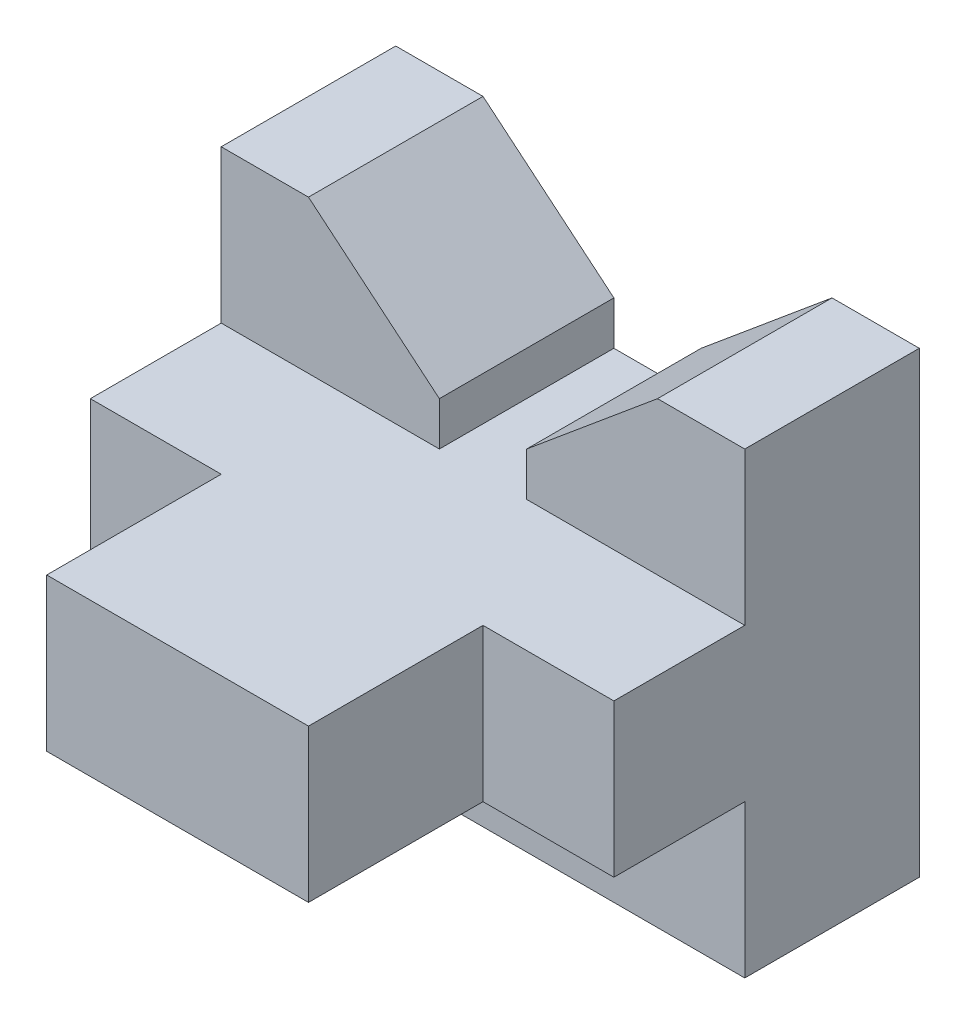
ISO-10303-21;
HEADER;
FILE_DESCRIPTION(('STEP AP214'),'2;1');
FILE_NAME('part.step','',(''),(''),'','','');
FILE_SCHEMA(('AUTOMOTIVE_DESIGN { 1 0 10303 214 1 1 1 1 }'));
ENDSEC;
DATA;
#1=APPLICATION_CONTEXT('core data for automotive mechanical design processes');
#2=APPLICATION_PROTOCOL_DEFINITION('international standard','automotive_design',2000,#1);
#3=PRODUCT_CONTEXT('',#1,'mechanical');
#4=PRODUCT('Part','Part','',(#3));
#5=PRODUCT_RELATED_PRODUCT_CATEGORY('part','',(#4));
#6=PRODUCT_DEFINITION_FORMATION('','',#4);
#7=PRODUCT_DEFINITION_CONTEXT('part definition',#1,'design');
#8=PRODUCT_DEFINITION('design','',#6,#7);
#9=PRODUCT_DEFINITION_SHAPE('','',#8);
#10=(LENGTH_UNIT() NAMED_UNIT(*) SI_UNIT(.MILLI.,.METRE.));
#11=(NAMED_UNIT(*) PLANE_ANGLE_UNIT() SI_UNIT($,.RADIAN.));
#12=(NAMED_UNIT(*) SI_UNIT($,.STERADIAN.) SOLID_ANGLE_UNIT());
#13=UNCERTAINTY_MEASURE_WITH_UNIT(LENGTH_MEASURE(1.E-05),#10,'distance_accuracy_value','');
#14=(GEOMETRIC_REPRESENTATION_CONTEXT(3) GLOBAL_UNCERTAINTY_ASSIGNED_CONTEXT((#13)) GLOBAL_UNIT_ASSIGNED_CONTEXT((#10,
#11,#12)) REPRESENTATION_CONTEXT('',''));
#15=CARTESIAN_POINT('',(0.,0.,0.));
#16=DIRECTION('',(0.,0.,1.));
#17=DIRECTION('',(1.,0.,0.));
#18=AXIS2_PLACEMENT_3D('',#15,#16,#17);
#19=CARTESIAN_POINT('',(38.1,14.0462,-34.3916));
#20=DIRECTION('',(0.,0.,1.));
#21=DIRECTION('',(0.,-1.,0.));
#22=AXIS2_PLACEMENT_3D('',#19,#20,#21);
#23=PLANE('',#22);
#24=DIRECTION('',(-0.768221279597376,0.64018439966448,0.));
#25=VECTOR('',#24,1.);
#26=CARTESIAN_POINT('',(-3.50186885245902,-4.20224262295082,-34.3916));
#27=LINE('',#26,#25);
#28=CARTESIAN_POINT('',(-6.35,-1.8288,-34.3916));
#29=VERTEX_POINT('',#28);
#30=CARTESIAN_POINT('',(-25.4,14.0462,-34.3916));
#31=VERTEX_POINT('',#30);
#32=EDGE_CURVE('E171',#29,#31,#27,.T.);
#33=ORIENTED_EDGE('',*,*,#32,.F.);
#34=DIRECTION('',(0.,1.,0.));
#35=VECTOR('',#34,1.);
#36=CARTESIAN_POINT('',(-6.35000000000001,0.,-34.3916));
#37=LINE('',#36,#35);
#38=CARTESIAN_POINT('',(-6.35,-8.1788,-34.3916));
#39=VERTEX_POINT('',#38);
#40=EDGE_CURVE('E160',#39,#29,#37,.T.);
#41=ORIENTED_EDGE('',*,*,#40,.F.);
#42=DIRECTION('',(1.,0.,0.));
#43=VECTOR('',#42,1.);
#44=CARTESIAN_POINT('',(0.,-8.1788,-34.3916));
#45=LINE('',#44,#43);
#46=CARTESIAN_POINT('',(6.35,-8.1788,-34.3916));
#47=VERTEX_POINT('',#46);
#48=EDGE_CURVE('E170',#39,#47,#45,.T.);
#49=ORIENTED_EDGE('',*,*,#48,.T.);
#50=DIRECTION('',(0.,1.,0.));
#51=VECTOR('',#50,1.);
#52=CARTESIAN_POINT('',(6.35,0.,-34.3916));
#53=LINE('',#52,#51);
#54=CARTESIAN_POINT('',(6.35,-1.8288,-34.3916));
#55=VERTEX_POINT('',#54);
#56=EDGE_CURVE('E189',#47,#55,#53,.T.);
#57=ORIENTED_EDGE('',*,*,#56,.T.);
#58=DIRECTION('',(0.768221279597376,0.64018439966448,0.));
#59=VECTOR('',#58,1.);
#60=CARTESIAN_POINT('',(3.50186885245902,-4.20224262295082,-34.3916));
#61=LINE('',#60,#59);
#62=CARTESIAN_POINT('',(25.4,14.0462,-34.3916));
#63=VERTEX_POINT('',#62);
#64=EDGE_CURVE('E178',#55,#63,#61,.T.);
#65=ORIENTED_EDGE('',*,*,#64,.T.);
#66=DIRECTION('',(-1.,0.,0.));
#67=VECTOR('',#66,1.);
#68=CARTESIAN_POINT('',(38.1,14.0462,-34.3916));
#69=LINE('',#68,#67);
#70=CARTESIAN_POINT('',(38.1,14.0462,-34.3916));
#71=VERTEX_POINT('',#70);
#72=EDGE_CURVE('E300',#71,#63,#69,.T.);
#73=ORIENTED_EDGE('',*,*,#72,.F.);
#74=DIRECTION('',(0.,1.,0.));
#75=VECTOR('',#74,1.);
#76=CARTESIAN_POINT('',(38.1,14.0462,-34.3916));
#77=LINE('',#76,#75);
#78=CARTESIAN_POINT('',(38.1,-52.6288,-34.3916));
#79=VERTEX_POINT('',#78);
#80=EDGE_CURVE('E337',#79,#71,#77,.T.);
#81=ORIENTED_EDGE('',*,*,#80,.F.);
#82=DIRECTION('',(-1.,0.,0.));
#83=VECTOR('',#82,1.);
#84=CARTESIAN_POINT('',(38.1,-52.6288,-34.3916));
#85=LINE('',#84,#83);
#86=CARTESIAN_POINT('',(-38.1,-52.6288,-34.3916));
#87=VERTEX_POINT('',#86);
#88=EDGE_CURVE('E297',#79,#87,#85,.T.);
#89=ORIENTED_EDGE('',*,*,#88,.T.);
#90=DIRECTION('',(0.,1.,0.));
#91=VECTOR('',#90,1.);
#92=CARTESIAN_POINT('',(-38.1,14.0462,-34.3916));
#93=LINE('',#92,#91);
#94=CARTESIAN_POINT('',(-38.1,14.0462,-34.3916));
#95=VERTEX_POINT('',#94);
#96=EDGE_CURVE('E265',#87,#95,#93,.T.);
#97=ORIENTED_EDGE('',*,*,#96,.T.);
#98=EDGE_CURVE('E182',#31,#95,#69,.T.);
#99=ORIENTED_EDGE('',*,*,#98,.F.);
#100=EDGE_LOOP('',(#33,#41,#49,#57,#65,#73,#81,#89,#97,#99));
#101=FACE_BOUND('',#100,.T.);
#102=ADVANCED_FACE('F35',(#101),#23,.F.);
#103=CARTESIAN_POINT('',(38.1,14.0462,-34.3916));
#104=DIRECTION('',(0.,-1.,0.));
#105=DIRECTION('',(0.,0.,-1.));
#106=AXIS2_PLACEMENT_3D('',#103,#104,#105);
#107=PLANE('',#106);
#108=DIRECTION('',(0.,0.,1.));
#109=VECTOR('',#108,1.);
#110=CARTESIAN_POINT('',(-25.4,14.0462,-34.3916));
#111=LINE('',#110,#109);
#112=CARTESIAN_POINT('',(-25.4,14.0462,-8.99160000000001));
#113=VERTEX_POINT('',#112);
#114=EDGE_CURVE('E198',#31,#113,#111,.T.);
#115=ORIENTED_EDGE('',*,*,#114,.F.);
#116=ORIENTED_EDGE('',*,*,#98,.T.);
#117=DIRECTION('',(0.,0.,1.));
#118=VECTOR('',#117,1.);
#119=CARTESIAN_POINT('',(-38.1,14.0462,-34.3916));
#120=LINE('',#119,#118);
#121=CARTESIAN_POINT('',(-38.1,14.0462,-8.99160000000001));
#122=VERTEX_POINT('',#121);
#123=EDGE_CURVE('E267',#95,#122,#120,.T.);
#124=ORIENTED_EDGE('',*,*,#123,.T.);
#125=DIRECTION('',(-1.,0.,0.));
#126=VECTOR('',#125,1.);
#127=CARTESIAN_POINT('',(38.1,14.0462,-8.99160000000001));
#128=LINE('',#127,#126);
#129=EDGE_CURVE('E304',#113,#122,#128,.T.);
#130=ORIENTED_EDGE('',*,*,#129,.F.);
#131=EDGE_LOOP('',(#115,#116,#124,#130));
#132=FACE_BOUND('',#131,.T.);
#133=ADVANCED_FACE('F369',(#132),#107,.F.);
#134=CARTESIAN_POINT('',(38.1,14.0462,-8.99160000000001));
#135=DIRECTION('',(0.,0.,-1.));
#136=DIRECTION('',(0.,1.,0.));
#137=AXIS2_PLACEMENT_3D('',#134,#135,#136);
#138=PLANE('',#137);
#139=DIRECTION('',(-0.768221279597376,0.64018439966448,0.));
#140=VECTOR('',#139,1.);
#141=CARTESIAN_POINT('',(-3.50186885245902,-4.20224262295082,-8.99160000000001));
#142=LINE('',#141,#140);
#143=CARTESIAN_POINT('',(-6.35,-1.8288,-8.99160000000001));
#144=VERTEX_POINT('',#143);
#145=EDGE_CURVE('E177',#144,#113,#142,.T.);
#146=ORIENTED_EDGE('',*,*,#145,.T.);
#147=ORIENTED_EDGE('',*,*,#129,.T.);
#148=DIRECTION('',(0.,-1.,0.));
#149=VECTOR('',#148,1.);
#150=CARTESIAN_POINT('',(-38.1,14.0462,-8.99160000000001));
#151=LINE('',#150,#149);
#152=CARTESIAN_POINT('',(-38.1,-8.1788,-8.99160000000001));
#153=VERTEX_POINT('',#152);
#154=EDGE_CURVE('E270',#122,#153,#151,.T.);
#155=ORIENTED_EDGE('',*,*,#154,.T.);
#156=DIRECTION('',(-1.,0.,0.));
#157=VECTOR('',#156,1.);
#158=CARTESIAN_POINT('',(38.1,-8.1788,-8.99160000000001));
#159=LINE('',#158,#157);
#160=CARTESIAN_POINT('',(-6.34999999999999,-8.1788,-8.99160000000001));
#161=VERTEX_POINT('',#160);
#162=EDGE_CURVE('E286',#161,#153,#159,.T.);
#163=ORIENTED_EDGE('',*,*,#162,.F.);
#164=DIRECTION('',(0.,1.,0.));
#165=VECTOR('',#164,1.);
#166=CARTESIAN_POINT('',(-6.35000000000001,0.,-8.99160000000001));
#167=LINE('',#166,#165);
#168=EDGE_CURVE('E52',#161,#144,#167,.T.);
#169=ORIENTED_EDGE('',*,*,#168,.T.);
#170=EDGE_LOOP('',(#146,#147,#155,#163,#169));
#171=FACE_BOUND('',#170,.T.);
#172=ADVANCED_FACE('F318',(#171),#138,.F.);
#173=CARTESIAN_POINT('',(38.1,-8.17880000000001,10.0584));
#174=DIRECTION('',(0.,0.,-1.));
#175=DIRECTION('',(0.,1.,0.));
#176=AXIS2_PLACEMENT_3D('',#173,#174,#175);
#177=PLANE('',#176);
#178=DIRECTION('',(0.,-1.,0.));
#179=VECTOR('',#178,1.);
#180=CARTESIAN_POINT('',(-19.05,-8.17880000000001,10.0584));
#181=LINE('',#180,#179);
#182=CARTESIAN_POINT('',(-19.05,-8.17880000000001,10.0584));
#183=VERTEX_POINT('',#182);
#184=CARTESIAN_POINT('',(-19.05,-30.4038,10.0584));
#185=VERTEX_POINT('',#184);
#186=EDGE_CURVE('E60',#183,#185,#181,.T.);
#187=ORIENTED_EDGE('',*,*,#186,.F.);
#188=DIRECTION('',(-1.,0.,0.));
#189=VECTOR('',#188,1.);
#190=CARTESIAN_POINT('',(38.1,-8.17880000000001,10.0584));
#191=LINE('',#190,#189);
#192=CARTESIAN_POINT('',(-38.1,-8.17880000000001,10.0584));
#193=VERTEX_POINT('',#192);
#194=EDGE_CURVE('E282',#183,#193,#191,.T.);
#195=ORIENTED_EDGE('',*,*,#194,.T.);
#196=DIRECTION('',(0.,-1.,0.));
#197=VECTOR('',#196,1.);
#198=CARTESIAN_POINT('',(-38.1,-8.17880000000001,10.0584));
#199=LINE('',#198,#197);
#200=CARTESIAN_POINT('',(-38.1,-30.4038,10.0584));
#201=VERTEX_POINT('',#200);
#202=EDGE_CURVE('E249',#193,#201,#199,.T.);
#203=ORIENTED_EDGE('',*,*,#202,.T.);
#204=DIRECTION('',(-1.,0.,0.));
#205=VECTOR('',#204,1.);
#206=CARTESIAN_POINT('',(38.1,-30.4038,10.0584));
#207=LINE('',#206,#205);
#208=EDGE_CURVE('E44',#185,#201,#207,.T.);
#209=ORIENTED_EDGE('',*,*,#208,.F.);
#210=EDGE_LOOP('',(#187,#195,#203,#209));
#211=FACE_BOUND('',#210,.T.);
#212=ADVANCED_FACE('F37',(#211),#177,.F.);
#213=DIRECTION('',(0.,1.,0.));
#214=VECTOR('',#213,1.);
#215=CARTESIAN_POINT('',(19.05,-8.17880000000001,10.0584));
#216=LINE('',#215,#214);
#217=CARTESIAN_POINT('',(19.05,-30.4038,10.0584));
#218=VERTEX_POINT('',#217);
#219=CARTESIAN_POINT('',(19.05,-8.17880000000001,10.0584));
#220=VERTEX_POINT('',#219);
#221=EDGE_CURVE('E212',#218,#220,#216,.T.);
#222=ORIENTED_EDGE('',*,*,#221,.F.);
#223=CARTESIAN_POINT('',(38.1,-30.4038,10.0584));
#224=VERTEX_POINT('',#223);
#225=EDGE_CURVE('E11',#224,#218,#207,.T.);
#226=ORIENTED_EDGE('',*,*,#225,.F.);
#227=DIRECTION('',(0.,-1.,0.));
#228=VECTOR('',#227,1.);
#229=CARTESIAN_POINT('',(38.1,-8.17880000000001,10.0584));
#230=LINE('',#229,#228);
#231=CARTESIAN_POINT('',(38.1,-8.17880000000001,10.0584));
#232=VERTEX_POINT('',#231);
#233=EDGE_CURVE('E276',#232,#224,#230,.T.);
#234=ORIENTED_EDGE('',*,*,#233,.F.);
#235=EDGE_CURVE('E284',#232,#220,#191,.T.);
#236=ORIENTED_EDGE('',*,*,#235,.T.);
#237=EDGE_LOOP('',(#222,#226,#234,#236));
#238=FACE_BOUND('',#237,.T.);
#239=ADVANCED_FACE('F355',(#238),#177,.F.);
#240=CARTESIAN_POINT('',(38.1,-30.4038,10.0584));
#241=DIRECTION('',(0.,1.,0.));
#242=DIRECTION('',(0.,0.,1.));
#243=AXIS2_PLACEMENT_3D('',#240,#241,#242);
#244=PLANE('',#243);
#245=DIRECTION('',(0.,0.,-1.));
#246=VECTOR('',#245,1.);
#247=CARTESIAN_POINT('',(-38.1,-30.4038,10.0584));
#248=LINE('',#247,#246);
#249=CARTESIAN_POINT('',(-38.1,-30.4038,-8.99160000000001));
#250=VERTEX_POINT('',#249);
#251=EDGE_CURVE('E253',#201,#250,#248,.T.);
#252=ORIENTED_EDGE('',*,*,#251,.T.);
#253=DIRECTION('',(-1.,0.,0.));
#254=VECTOR('',#253,1.);
#255=CARTESIAN_POINT('',(38.1,-30.4038,-8.99160000000001));
#256=LINE('',#255,#254);
#257=CARTESIAN_POINT('',(38.1,-30.4038,-8.99160000000001));
#258=VERTEX_POINT('',#257);
#259=EDGE_CURVE('E288',#258,#250,#256,.T.);
#260=ORIENTED_EDGE('',*,*,#259,.F.);
#261=DIRECTION('',(0.,0.,-1.));
#262=VECTOR('',#261,1.);
#263=CARTESIAN_POINT('',(38.1,-30.4038,10.0584));
#264=LINE('',#263,#262);
#265=EDGE_CURVE('E335',#224,#258,#264,.T.);
#266=ORIENTED_EDGE('',*,*,#265,.F.);
#267=ORIENTED_EDGE('',*,*,#225,.T.);
#268=DIRECTION('',(0.,0.,-1.));
#269=VECTOR('',#268,1.);
#270=CARTESIAN_POINT('',(19.05,-30.4038,35.4584));
#271=LINE('',#270,#269);
#272=CARTESIAN_POINT('',(19.05,-30.4038,35.4584));
#273=VERTEX_POINT('',#272);
#274=EDGE_CURVE('E233',#273,#218,#271,.T.);
#275=ORIENTED_EDGE('',*,*,#274,.F.);
#276=DIRECTION('',(1.,0.,0.));
#277=VECTOR('',#276,1.);
#278=CARTESIAN_POINT('',(-19.05,-30.4038,35.4584));
#279=LINE('',#278,#277);
#280=CARTESIAN_POINT('',(-19.05,-30.4038,35.4584));
#281=VERTEX_POINT('',#280);
#282=EDGE_CURVE('E211',#281,#273,#279,.T.);
#283=ORIENTED_EDGE('',*,*,#282,.F.);
#284=DIRECTION('',(0.,0.,-1.));
#285=VECTOR('',#284,1.);
#286=CARTESIAN_POINT('',(-19.05,-30.4038,35.4584));
#287=LINE('',#286,#285);
#288=EDGE_CURVE('E240',#281,#185,#287,.T.);
#289=ORIENTED_EDGE('',*,*,#288,.T.);
#290=ORIENTED_EDGE('',*,*,#208,.T.);
#291=EDGE_LOOP('',(#252,#260,#266,#267,#275,#283,#289,#290));
#292=FACE_BOUND('',#291,.T.);
#293=ADVANCED_FACE('F326',(#292),#244,.F.);
#294=CARTESIAN_POINT('',(38.1,-30.4038,-8.99160000000001));
#295=DIRECTION('',(0.,0.,-1.));
#296=DIRECTION('',(0.,1.,0.));
#297=AXIS2_PLACEMENT_3D('',#294,#295,#296);
#298=PLANE('',#297);
#299=DIRECTION('',(0.,-1.,0.));
#300=VECTOR('',#299,1.);
#301=CARTESIAN_POINT('',(-38.1,-30.4038,-8.99160000000001));
#302=LINE('',#301,#300);
#303=CARTESIAN_POINT('',(-38.1,-52.6288,-8.99160000000002));
#304=VERTEX_POINT('',#303);
#305=EDGE_CURVE('E256',#250,#304,#302,.T.);
#306=ORIENTED_EDGE('',*,*,#305,.T.);
#307=DIRECTION('',(-1.,0.,0.));
#308=VECTOR('',#307,1.);
#309=CARTESIAN_POINT('',(38.1,-52.6288,-8.99160000000002));
#310=LINE('',#309,#308);
#311=CARTESIAN_POINT('',(38.1,-52.6288,-8.99160000000002));
#312=VERTEX_POINT('',#311);
#313=EDGE_CURVE('E294',#312,#304,#310,.T.);
#314=ORIENTED_EDGE('',*,*,#313,.F.);
#315=DIRECTION('',(0.,-1.,0.));
#316=VECTOR('',#315,1.);
#317=CARTESIAN_POINT('',(38.1,-30.4038,-8.99160000000001));
#318=LINE('',#317,#316);
#319=EDGE_CURVE('E331',#258,#312,#318,.T.);
#320=ORIENTED_EDGE('',*,*,#319,.F.);
#321=ORIENTED_EDGE('',*,*,#259,.T.);
#322=EDGE_LOOP('',(#306,#314,#320,#321));
#323=FACE_BOUND('',#322,.T.);
#324=ADVANCED_FACE('F329',(#323),#298,.F.);
#325=CARTESIAN_POINT('',(38.1,-52.6288,-8.99160000000002));
#326=DIRECTION('',(0.,1.,0.));
#327=DIRECTION('',(0.,0.,1.));
#328=AXIS2_PLACEMENT_3D('',#325,#326,#327);
#329=PLANE('',#328);
#330=DIRECTION('',(0.,0.,-1.));
#331=VECTOR('',#330,1.);
#332=CARTESIAN_POINT('',(-38.1,-52.6288,-8.99160000000002));
#333=LINE('',#332,#331);
#334=EDGE_CURVE('E263',#304,#87,#333,.T.);
#335=ORIENTED_EDGE('',*,*,#334,.T.);
#336=ORIENTED_EDGE('',*,*,#88,.F.);
#337=DIRECTION('',(0.,0.,-1.));
#338=VECTOR('',#337,1.);
#339=CARTESIAN_POINT('',(38.1,-52.6288,-8.99160000000002));
#340=LINE('',#339,#338);
#341=EDGE_CURVE('E334',#312,#79,#340,.T.);
#342=ORIENTED_EDGE('',*,*,#341,.F.);
#343=ORIENTED_EDGE('',*,*,#313,.T.);
#344=EDGE_LOOP('',(#335,#336,#342,#343));
#345=FACE_BOUND('',#344,.T.);
#346=ADVANCED_FACE('F379',(#345),#329,.F.);
#347=ORIENTED_EDGE('',*,*,#72,.T.);
#348=DIRECTION('',(0.,0.,1.));
#349=VECTOR('',#348,1.);
#350=CARTESIAN_POINT('',(25.4,14.0462,-34.3916));
#351=LINE('',#350,#349);
#352=CARTESIAN_POINT('',(25.4,14.0462,-8.99160000000001));
#353=VERTEX_POINT('',#352);
#354=EDGE_CURVE('E200',#63,#353,#351,.T.);
#355=ORIENTED_EDGE('',*,*,#354,.T.);
#356=CARTESIAN_POINT('',(38.1,14.0462,-8.99160000000001));
#357=VERTEX_POINT('',#356);
#358=EDGE_CURVE('E302',#357,#353,#128,.T.);
#359=ORIENTED_EDGE('',*,*,#358,.F.);
#360=DIRECTION('',(0.,0.,1.));
#361=VECTOR('',#360,1.);
#362=CARTESIAN_POINT('',(38.1,14.0462,-34.3916));
#363=LINE('',#362,#361);
#364=EDGE_CURVE('E342',#71,#357,#363,.T.);
#365=ORIENTED_EDGE('',*,*,#364,.F.);
#366=EDGE_LOOP('',(#347,#355,#359,#365));
#367=FACE_BOUND('',#366,.T.);
#368=ADVANCED_FACE('F376',(#367),#107,.F.);
#369=ORIENTED_EDGE('',*,*,#358,.T.);
#370=DIRECTION('',(0.768221279597376,0.64018439966448,0.));
#371=VECTOR('',#370,1.);
#372=CARTESIAN_POINT('',(3.50186885245902,-4.20224262295082,-8.99160000000001));
#373=LINE('',#372,#371);
#374=CARTESIAN_POINT('',(6.35,-1.8288,-8.99160000000001));
#375=VERTEX_POINT('',#374);
#376=EDGE_CURVE('E183',#375,#353,#373,.T.);
#377=ORIENTED_EDGE('',*,*,#376,.F.);
#378=DIRECTION('',(0.,1.,0.));
#379=VECTOR('',#378,1.);
#380=CARTESIAN_POINT('',(6.35,0.,-8.99160000000001));
#381=LINE('',#380,#379);
#382=CARTESIAN_POINT('',(6.35,-8.1788,-8.99160000000001));
#383=VERTEX_POINT('',#382);
#384=EDGE_CURVE('E185',#383,#375,#381,.T.);
#385=ORIENTED_EDGE('',*,*,#384,.F.);
#386=CARTESIAN_POINT('',(38.1,-8.1788,-8.99160000000001));
#387=VERTEX_POINT('',#386);
#388=EDGE_CURVE('E279',#387,#383,#159,.T.);
#389=ORIENTED_EDGE('',*,*,#388,.F.);
#390=DIRECTION('',(0.,-1.,0.));
#391=VECTOR('',#390,1.);
#392=CARTESIAN_POINT('',(38.1,14.0462,-8.99160000000001));
#393=LINE('',#392,#391);
#394=EDGE_CURVE('E343',#357,#387,#393,.T.);
#395=ORIENTED_EDGE('',*,*,#394,.F.);
#396=EDGE_LOOP('',(#369,#377,#385,#389,#395));
#397=FACE_BOUND('',#396,.T.);
#398=ADVANCED_FACE('F365',(#397),#138,.F.);
#399=CARTESIAN_POINT('',(38.1,-8.1788,-8.99160000000001));
#400=DIRECTION('',(0.,-1.,0.));
#401=DIRECTION('',(0.,0.,-1.));
#402=AXIS2_PLACEMENT_3D('',#399,#400,#401);
#403=PLANE('',#402);
#404=DIRECTION('',(0.,0.,1.));
#405=VECTOR('',#404,1.);
#406=CARTESIAN_POINT('',(-38.1,-8.1788,-8.99160000000001));
#407=LINE('',#406,#405);
#408=EDGE_CURVE('E273',#153,#193,#407,.T.);
#409=ORIENTED_EDGE('',*,*,#408,.T.);
#410=ORIENTED_EDGE('',*,*,#194,.F.);
#411=DIRECTION('',(0.,0.,-1.));
#412=VECTOR('',#411,1.);
#413=CARTESIAN_POINT('',(-19.05,-8.17880000000001,35.4584));
#414=LINE('',#413,#412);
#415=CARTESIAN_POINT('',(-19.05,-8.17880000000001,35.4584));
#416=VERTEX_POINT('',#415);
#417=EDGE_CURVE('E218',#416,#183,#414,.T.);
#418=ORIENTED_EDGE('',*,*,#417,.F.);
#419=DIRECTION('',(-1.,0.,0.));
#420=VECTOR('',#419,1.);
#421=CARTESIAN_POINT('',(-19.05,-8.17880000000001,35.4584));
#422=LINE('',#421,#420);
#423=CARTESIAN_POINT('',(19.05,-8.17880000000001,35.4584));
#424=VERTEX_POINT('',#423);
#425=EDGE_CURVE('E216',#424,#416,#422,.T.);
#426=ORIENTED_EDGE('',*,*,#425,.F.);
#427=DIRECTION('',(0.,0.,-1.));
#428=VECTOR('',#427,1.);
#429=CARTESIAN_POINT('',(19.05,-8.17880000000001,35.4584));
#430=LINE('',#429,#428);
#431=EDGE_CURVE('E228',#424,#220,#430,.T.);
#432=ORIENTED_EDGE('',*,*,#431,.T.);
#433=ORIENTED_EDGE('',*,*,#235,.F.);
#434=DIRECTION('',(0.,0.,1.));
#435=VECTOR('',#434,1.);
#436=CARTESIAN_POINT('',(38.1,-8.1788,-8.99160000000001));
#437=LINE('',#436,#435);
#438=EDGE_CURVE('E259',#387,#232,#437,.T.);
#439=ORIENTED_EDGE('',*,*,#438,.F.);
#440=ORIENTED_EDGE('',*,*,#388,.T.);
#441=DIRECTION('',(0.,0.,1.));
#442=VECTOR('',#441,1.);
#443=CARTESIAN_POINT('',(6.35,-8.1788,-34.3916));
#444=LINE('',#443,#442);
#445=EDGE_CURVE('E205',#47,#383,#444,.T.);
#446=ORIENTED_EDGE('',*,*,#445,.F.);
#447=ORIENTED_EDGE('',*,*,#48,.F.);
#448=DIRECTION('',(0.,0.,1.));
#449=VECTOR('',#448,1.);
#450=CARTESIAN_POINT('',(-6.35,-8.1788,-34.3916));
#451=LINE('',#450,#449);
#452=EDGE_CURVE('E165',#39,#161,#451,.T.);
#453=ORIENTED_EDGE('',*,*,#452,.T.);
#454=ORIENTED_EDGE('',*,*,#162,.T.);
#455=EDGE_LOOP('',(#409,#410,#418,#426,#432,#433,#439,#440,#446,#447,#453,#454));
#456=FACE_BOUND('',#455,.T.);
#457=ADVANCED_FACE('F315',(#456),#403,.F.);
#458=CARTESIAN_POINT('',(38.1,0.,0.));
#459=DIRECTION('',(1.,0.,0.));
#460=DIRECTION('',(0.,0.,-1.));
#461=AXIS2_PLACEMENT_3D('',#458,#459,#460);
#462=PLANE('',#461);
#463=ORIENTED_EDGE('',*,*,#233,.T.);
#464=ORIENTED_EDGE('',*,*,#265,.T.);
#465=ORIENTED_EDGE('',*,*,#319,.T.);
#466=ORIENTED_EDGE('',*,*,#341,.T.);
#467=ORIENTED_EDGE('',*,*,#80,.T.);
#468=ORIENTED_EDGE('',*,*,#364,.T.);
#469=ORIENTED_EDGE('',*,*,#394,.T.);
#470=ORIENTED_EDGE('',*,*,#438,.T.);
#471=EDGE_LOOP('',(#463,#464,#465,#466,#467,#468,#469,#470));
#472=FACE_BOUND('',#471,.T.);
#473=ADVANCED_FACE('F357',(#472),#462,.T.);
#474=CARTESIAN_POINT('',(-38.1,0.,0.));
#475=DIRECTION('',(1.,0.,0.));
#476=DIRECTION('',(0.,0.,-1.));
#477=AXIS2_PLACEMENT_3D('',#474,#475,#476);
#478=PLANE('',#477);
#479=ORIENTED_EDGE('',*,*,#202,.F.);
#480=ORIENTED_EDGE('',*,*,#408,.F.);
#481=ORIENTED_EDGE('',*,*,#154,.F.);
#482=ORIENTED_EDGE('',*,*,#123,.F.);
#483=ORIENTED_EDGE('',*,*,#96,.F.);
#484=ORIENTED_EDGE('',*,*,#334,.F.);
#485=ORIENTED_EDGE('',*,*,#305,.F.);
#486=ORIENTED_EDGE('',*,*,#251,.F.);
#487=EDGE_LOOP('',(#479,#480,#481,#482,#483,#484,#485,#486));
#488=FACE_BOUND('',#487,.T.);
#489=ADVANCED_FACE('F321',(#488),#478,.F.);
#490=CARTESIAN_POINT('',(-19.05,-8.17880000000001,35.4584));
#491=DIRECTION('',(1.,0.,0.));
#492=DIRECTION('',(0.,1.,0.));
#493=AXIS2_PLACEMENT_3D('',#490,#491,#492);
#494=PLANE('',#493);
#495=ORIENTED_EDGE('',*,*,#186,.T.);
#496=ORIENTED_EDGE('',*,*,#288,.F.);
#497=DIRECTION('',(0.,-1.,0.));
#498=VECTOR('',#497,1.);
#499=CARTESIAN_POINT('',(-19.05,-8.17880000000001,35.4584));
#500=LINE('',#499,#498);
#501=EDGE_CURVE('E208',#416,#281,#500,.T.);
#502=ORIENTED_EDGE('',*,*,#501,.F.);
#503=ORIENTED_EDGE('',*,*,#417,.T.);
#504=EDGE_LOOP('',(#495,#496,#502,#503));
#505=FACE_BOUND('',#504,.T.);
#506=ADVANCED_FACE('F345',(#505),#494,.F.);
#507=CARTESIAN_POINT('',(19.05,-8.17880000000001,35.4584));
#508=DIRECTION('',(-1.,0.,0.));
#509=DIRECTION('',(0.,-1.,0.));
#510=AXIS2_PLACEMENT_3D('',#507,#508,#509);
#511=PLANE('',#510);
#512=ORIENTED_EDGE('',*,*,#221,.T.);
#513=ORIENTED_EDGE('',*,*,#431,.F.);
#514=DIRECTION('',(0.,1.,0.));
#515=VECTOR('',#514,1.);
#516=CARTESIAN_POINT('',(19.05,-8.17880000000001,35.4584));
#517=LINE('',#516,#515);
#518=EDGE_CURVE('E214',#273,#424,#517,.T.);
#519=ORIENTED_EDGE('',*,*,#518,.F.);
#520=ORIENTED_EDGE('',*,*,#274,.T.);
#521=EDGE_LOOP('',(#512,#513,#519,#520));
#522=FACE_BOUND('',#521,.T.);
#523=ADVANCED_FACE('F352',(#522),#511,.F.);
#524=CARTESIAN_POINT('',(0.,0.,35.4584));
#525=DIRECTION('',(0.,0.,1.));
#526=DIRECTION('',(1.,0.,0.));
#527=AXIS2_PLACEMENT_3D('',#524,#525,#526);
#528=PLANE('',#527);
#529=ORIENTED_EDGE('',*,*,#501,.T.);
#530=ORIENTED_EDGE('',*,*,#282,.T.);
#531=ORIENTED_EDGE('',*,*,#518,.T.);
#532=ORIENTED_EDGE('',*,*,#425,.T.);
#533=EDGE_LOOP('',(#529,#530,#531,#532));
#534=FACE_BOUND('',#533,.T.);
#535=ADVANCED_FACE('F347',(#534),#528,.T.);
#536=CARTESIAN_POINT('',(-3.50186885245902,-4.20224262295082,-34.3916));
#537=DIRECTION('',(0.64018439966448,0.768221279597376,0.));
#538=DIRECTION('',(-0.768221279597376,0.64018439966448,0.));
#539=AXIS2_PLACEMENT_3D('',#536,#537,#538);
#540=PLANE('',#539);
#541=ORIENTED_EDGE('',*,*,#145,.F.);
#542=DIRECTION('',(0.,0.,1.));
#543=VECTOR('',#542,1.);
#544=CARTESIAN_POINT('',(-6.35,-1.8288,-34.3916));
#545=LINE('',#544,#543);
#546=EDGE_CURVE('E163',#29,#144,#545,.T.);
#547=ORIENTED_EDGE('',*,*,#546,.F.);
#548=ORIENTED_EDGE('',*,*,#32,.T.);
#549=ORIENTED_EDGE('',*,*,#114,.T.);
#550=EDGE_LOOP('',(#541,#547,#548,#549));
#551=FACE_BOUND('',#550,.T.);
#552=ADVANCED_FACE('F174',(#551),#540,.T.);
#553=CARTESIAN_POINT('',(3.50186885245902,-4.20224262295082,-34.3916));
#554=DIRECTION('',(0.64018439966448,-0.768221279597376,0.));
#555=DIRECTION('',(0.768221279597376,0.64018439966448,0.));
#556=AXIS2_PLACEMENT_3D('',#553,#554,#555);
#557=PLANE('',#556);
#558=ORIENTED_EDGE('',*,*,#376,.T.);
#559=ORIENTED_EDGE('',*,*,#354,.F.);
#560=ORIENTED_EDGE('',*,*,#64,.F.);
#561=DIRECTION('',(0.,0.,1.));
#562=VECTOR('',#561,1.);
#563=CARTESIAN_POINT('',(6.35,-1.8288,-34.3916));
#564=LINE('',#563,#562);
#565=EDGE_CURVE('E203',#55,#375,#564,.T.);
#566=ORIENTED_EDGE('',*,*,#565,.T.);
#567=EDGE_LOOP('',(#558,#559,#560,#566));
#568=FACE_BOUND('',#567,.T.);
#569=ADVANCED_FACE('F409',(#568),#557,.F.);
#570=CARTESIAN_POINT('',(6.35,0.,-34.3916));
#571=DIRECTION('',(1.,0.,0.));
#572=DIRECTION('',(0.,1.,0.));
#573=AXIS2_PLACEMENT_3D('',#570,#571,#572);
#574=PLANE('',#573);
#575=ORIENTED_EDGE('',*,*,#384,.T.);
#576=ORIENTED_EDGE('',*,*,#565,.F.);
#577=ORIENTED_EDGE('',*,*,#56,.F.);
#578=ORIENTED_EDGE('',*,*,#445,.T.);
#579=EDGE_LOOP('',(#575,#576,#577,#578));
#580=FACE_BOUND('',#579,.T.);
#581=ADVANCED_FACE('F412',(#580),#574,.F.);
#582=CARTESIAN_POINT('',(-6.35000000000001,0.,-34.3916));
#583=DIRECTION('',(1.,0.,0.));
#584=DIRECTION('',(0.,1.,0.));
#585=AXIS2_PLACEMENT_3D('',#582,#583,#584);
#586=PLANE('',#585);
#587=ORIENTED_EDGE('',*,*,#168,.F.);
#588=ORIENTED_EDGE('',*,*,#452,.F.);
#589=ORIENTED_EDGE('',*,*,#40,.T.);
#590=ORIENTED_EDGE('',*,*,#546,.T.);
#591=EDGE_LOOP('',(#587,#588,#589,#590));
#592=FACE_BOUND('',#591,.T.);
#593=ADVANCED_FACE('F162',(#592),#586,.T.);
#594=CLOSED_SHELL('',(#102,#133,#172,#212,#239,#293,#324,#346,#368,#398,#457,#473,#489,#506,
#523,#535,#552,#569,#581,#593));
#595=MANIFOLD_SOLID_BREP('B2',#594);
#596=ADVANCED_BREP_SHAPE_REPRESENTATION('',(#18,#595),#14);
#597=SHAPE_DEFINITION_REPRESENTATION(#9,#596);
ENDSEC;
END-ISO-10303-21;
